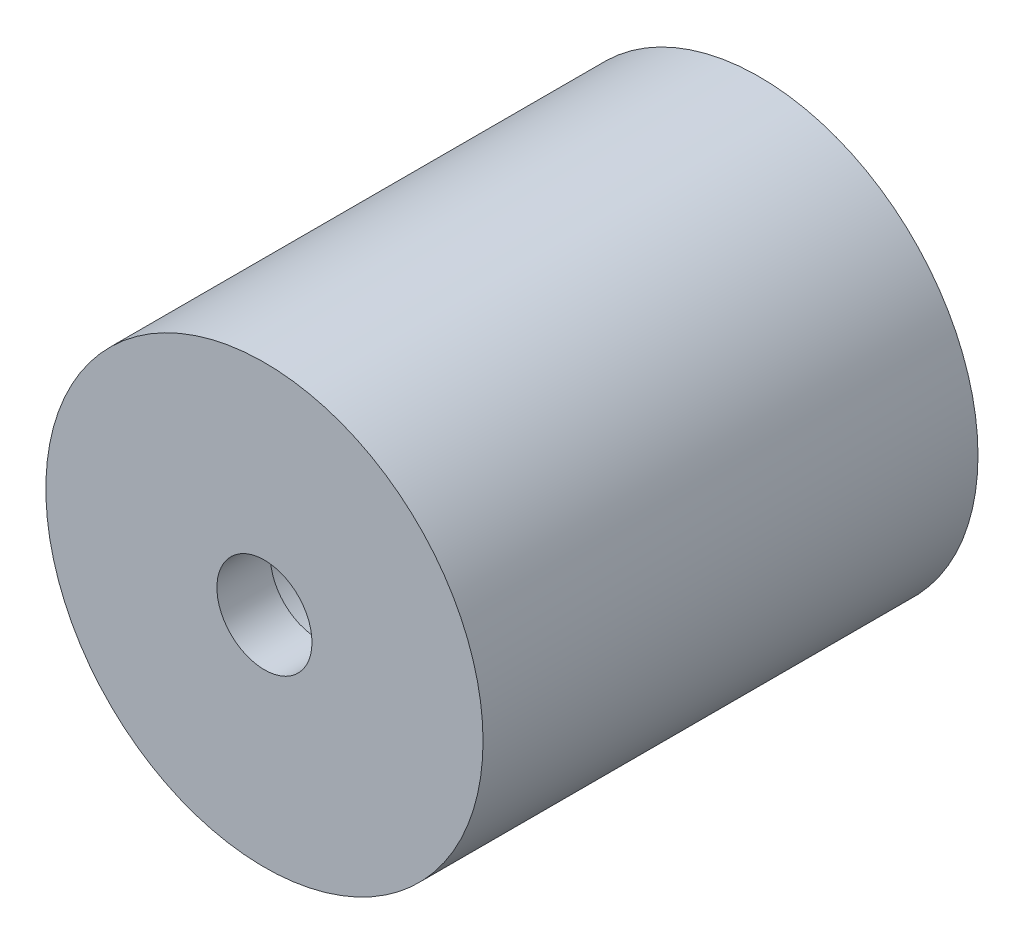
ISO-10303-21;
HEADER;
FILE_DESCRIPTION(('STEP AP214'),'2;1');
FILE_NAME('part.step','',(''),(''),'','','');
FILE_SCHEMA(('AUTOMOTIVE_DESIGN { 1 0 10303 214 1 1 1 1 }'));
ENDSEC;
DATA;
#1=APPLICATION_CONTEXT('core data for automotive mechanical design processes');
#2=APPLICATION_PROTOCOL_DEFINITION('international standard','automotive_design',2000,#1);
#3=PRODUCT_CONTEXT('',#1,'mechanical');
#4=PRODUCT('Part','Part','',(#3));
#5=PRODUCT_RELATED_PRODUCT_CATEGORY('part','',(#4));
#6=PRODUCT_DEFINITION_FORMATION('','',#4);
#7=PRODUCT_DEFINITION_CONTEXT('part definition',#1,'design');
#8=PRODUCT_DEFINITION('design','',#6,#7);
#9=PRODUCT_DEFINITION_SHAPE('','',#8);
#10=(LENGTH_UNIT() NAMED_UNIT(*) SI_UNIT(.MILLI.,.METRE.));
#11=(NAMED_UNIT(*) PLANE_ANGLE_UNIT() SI_UNIT($,.RADIAN.));
#12=(NAMED_UNIT(*) SI_UNIT($,.STERADIAN.) SOLID_ANGLE_UNIT());
#13=UNCERTAINTY_MEASURE_WITH_UNIT(LENGTH_MEASURE(1.E-05),#10,'distance_accuracy_value','');
#14=(GEOMETRIC_REPRESENTATION_CONTEXT(3) GLOBAL_UNCERTAINTY_ASSIGNED_CONTEXT((#13)) GLOBAL_UNIT_ASSIGNED_CONTEXT((#10,
#11,#12)) REPRESENTATION_CONTEXT('',''));
#15=CARTESIAN_POINT('',(0.,0.,0.));
#16=DIRECTION('',(0.,0.,1.));
#17=DIRECTION('',(1.,0.,0.));
#18=AXIS2_PLACEMENT_3D('',#15,#16,#17);
#19=CARTESIAN_POINT('',(0.,0.,0.));
#20=DIRECTION('',(0.,0.,1.));
#21=DIRECTION('',(1.,0.,0.));
#22=AXIS2_PLACEMENT_3D('',#19,#20,#21);
#23=PLANE('',#22);
#24=CARTESIAN_POINT('',(0.,0.,0.));
#25=DIRECTION('',(0.,0.,1.));
#26=DIRECTION('',(1.,0.,0.));
#27=AXIS2_PLACEMENT_3D('',#24,#25,#26);
#28=CIRCLE('',#27,1.778);
#29=CARTESIAN_POINT('',(1.778,0.,0.));
#30=VERTEX_POINT('',#29);
#31=EDGE_CURVE('E41',#30,#30,#28,.T.);
#32=ORIENTED_EDGE('',*,*,#31,.T.);
#33=EDGE_LOOP('',(#32));
#34=FACE_BOUND('',#33,.T.);
#35=CARTESIAN_POINT('',(0.,0.,0.));
#36=DIRECTION('',(0.,0.,1.));
#37=DIRECTION('',(1.,0.,0.));
#38=AXIS2_PLACEMENT_3D('',#35,#36,#37);
#39=CIRCLE('',#38,3.175);
#40=CARTESIAN_POINT('',(3.175,0.,0.));
#41=VERTEX_POINT('',#40);
#42=EDGE_CURVE('E10',#41,#41,#39,.T.);
#43=ORIENTED_EDGE('',*,*,#42,.F.);
#44=EDGE_LOOP('',(#43));
#45=FACE_BOUND('',#44,.T.);
#46=ADVANCED_FACE('F37',(#34,#45),#23,.F.);
#47=CARTESIAN_POINT('',(0.,0.,2.));
#48=DIRECTION('',(0.,0.,-1.));
#49=DIRECTION('',(-1.,0.,0.));
#50=AXIS2_PLACEMENT_3D('',#47,#48,#49);
#51=CYLINDRICAL_SURFACE('',#50,1.778);
#52=CARTESIAN_POINT('',(0.,0.,2.));
#53=DIRECTION('',(0.,0.,1.));
#54=DIRECTION('',(1.,0.,0.));
#55=AXIS2_PLACEMENT_3D('',#52,#53,#54);
#56=CIRCLE('',#55,1.778);
#57=CARTESIAN_POINT('',(1.778,0.,2.));
#58=VERTEX_POINT('',#57);
#59=EDGE_CURVE('E52',#58,#58,#56,.T.);
#60=ORIENTED_EDGE('',*,*,#59,.T.);
#61=EDGE_LOOP('',(#60));
#62=FACE_BOUND('',#61,.T.);
#63=ORIENTED_EDGE('',*,*,#31,.F.);
#64=EDGE_LOOP('',(#63));
#65=FACE_BOUND('',#64,.T.);
#66=ADVANCED_FACE('F39',(#62,#65),#51,.F.);
#67=CARTESIAN_POINT('',(0.,0.,2.));
#68=DIRECTION('',(0.,0.,-1.));
#69=DIRECTION('',(-1.,0.,0.));
#70=AXIS2_PLACEMENT_3D('',#67,#68,#69);
#71=CYLINDRICAL_SURFACE('',#70,8.175);
#72=CARTESIAN_POINT('',(0.,0.,2.));
#73=DIRECTION('',(0.,0.,1.));
#74=DIRECTION('',(1.,0.,0.));
#75=AXIS2_PLACEMENT_3D('',#72,#73,#74);
#76=CIRCLE('',#75,8.175);
#77=CARTESIAN_POINT('',(8.175,0.,2.));
#78=VERTEX_POINT('',#77);
#79=EDGE_CURVE('E46',#78,#78,#76,.T.);
#80=ORIENTED_EDGE('',*,*,#79,.F.);
#81=EDGE_LOOP('',(#80));
#82=FACE_BOUND('',#81,.T.);
#83=CARTESIAN_POINT('',(0.,0.,-16.51));
#84=DIRECTION('',(0.,0.,1.));
#85=DIRECTION('',(1.,0.,0.));
#86=AXIS2_PLACEMENT_3D('',#83,#84,#85);
#87=CIRCLE('',#86,8.175);
#88=CARTESIAN_POINT('',(8.175,0.,-16.51));
#89=VERTEX_POINT('',#88);
#90=EDGE_CURVE('E55',#89,#89,#87,.T.);
#91=ORIENTED_EDGE('',*,*,#90,.T.);
#92=EDGE_LOOP('',(#91));
#93=FACE_BOUND('',#92,.T.);
#94=ADVANCED_FACE('F86',(#82,#93),#71,.T.);
#95=CARTESIAN_POINT('',(0.,0.,2.));
#96=DIRECTION('',(0.,0.,1.));
#97=DIRECTION('',(1.,0.,0.));
#98=AXIS2_PLACEMENT_3D('',#95,#96,#97);
#99=PLANE('',#98);
#100=ORIENTED_EDGE('',*,*,#59,.F.);
#101=EDGE_LOOP('',(#100));
#102=FACE_BOUND('',#101,.T.);
#103=ORIENTED_EDGE('',*,*,#79,.T.);
#104=EDGE_LOOP('',(#103));
#105=FACE_BOUND('',#104,.T.);
#106=ADVANCED_FACE('F79',(#102,#105),#99,.T.);
#107=CARTESIAN_POINT('',(0.,0.,-16.51));
#108=DIRECTION('',(0.,0.,1.));
#109=DIRECTION('',(1.,0.,0.));
#110=AXIS2_PLACEMENT_3D('',#107,#108,#109);
#111=CYLINDRICAL_SURFACE('',#110,3.175);
#112=CARTESIAN_POINT('',(0.,0.,-16.51));
#113=DIRECTION('',(0.,0.,1.));
#114=DIRECTION('',(1.,0.,0.));
#115=AXIS2_PLACEMENT_3D('',#112,#113,#114);
#116=CIRCLE('',#115,3.175);
#117=CARTESIAN_POINT('',(3.175,0.,-16.51));
#118=VERTEX_POINT('',#117);
#119=EDGE_CURVE('E67',#118,#118,#116,.T.);
#120=ORIENTED_EDGE('',*,*,#119,.F.);
#121=EDGE_LOOP('',(#120));
#122=FACE_BOUND('',#121,.T.);
#123=ORIENTED_EDGE('',*,*,#42,.T.);
#124=EDGE_LOOP('',(#123));
#125=FACE_BOUND('',#124,.T.);
#126=ADVANCED_FACE('F77',(#122,#125),#111,.F.);
#127=CARTESIAN_POINT('',(0.,0.,-16.51));
#128=DIRECTION('',(0.,0.,1.));
#129=DIRECTION('',(1.,0.,0.));
#130=AXIS2_PLACEMENT_3D('',#127,#128,#129);
#131=PLANE('',#130);
#132=ORIENTED_EDGE('',*,*,#119,.T.);
#133=EDGE_LOOP('',(#132));
#134=FACE_BOUND('',#133,.T.);
#135=ORIENTED_EDGE('',*,*,#90,.F.);
#136=EDGE_LOOP('',(#135));
#137=FACE_BOUND('',#136,.T.);
#138=ADVANCED_FACE('F74',(#134,#137),#131,.F.);
#139=CLOSED_SHELL('',(#46,#66,#94,#106,#126,#138));
#140=MANIFOLD_SOLID_BREP('B2',#139);
#141=ADVANCED_BREP_SHAPE_REPRESENTATION('',(#18,#140),#14);
#142=SHAPE_DEFINITION_REPRESENTATION(#9,#141);
ENDSEC;
END-ISO-10303-21;
